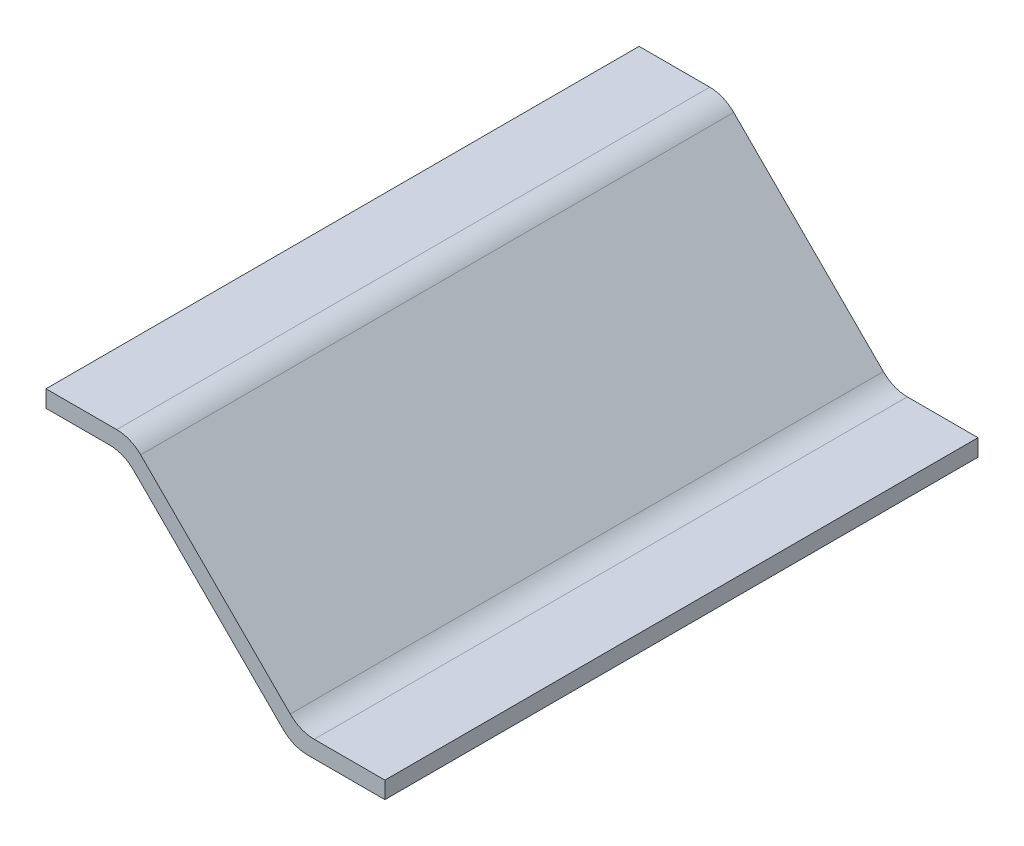
ISO-10303-21;
HEADER;
FILE_DESCRIPTION(('STEP AP214'),'2;1');
FILE_NAME('part.step','',(''),(''),'','','');
FILE_SCHEMA(('AUTOMOTIVE_DESIGN { 1 0 10303 214 1 1 1 1 }'));
ENDSEC;
DATA;
#1=APPLICATION_CONTEXT('core data for automotive mechanical design processes');
#2=APPLICATION_PROTOCOL_DEFINITION('international standard','automotive_design',2000,#1);
#3=PRODUCT_CONTEXT('',#1,'mechanical');
#4=PRODUCT('Part','Part','',(#3));
#5=PRODUCT_RELATED_PRODUCT_CATEGORY('part','',(#4));
#6=PRODUCT_DEFINITION_FORMATION('','',#4);
#7=PRODUCT_DEFINITION_CONTEXT('part definition',#1,'design');
#8=PRODUCT_DEFINITION('design','',#6,#7);
#9=PRODUCT_DEFINITION_SHAPE('','',#8);
#10=(LENGTH_UNIT() NAMED_UNIT(*) SI_UNIT(.MILLI.,.METRE.));
#11=(NAMED_UNIT(*) PLANE_ANGLE_UNIT() SI_UNIT($,.RADIAN.));
#12=(NAMED_UNIT(*) SI_UNIT($,.STERADIAN.) SOLID_ANGLE_UNIT());
#13=UNCERTAINTY_MEASURE_WITH_UNIT(LENGTH_MEASURE(1.E-05),#10,'distance_accuracy_value','');
#14=(GEOMETRIC_REPRESENTATION_CONTEXT(3) GLOBAL_UNCERTAINTY_ASSIGNED_CONTEXT((#13)) GLOBAL_UNIT_ASSIGNED_CONTEXT((#10,
#11,#12)) REPRESENTATION_CONTEXT('',''));
#15=CARTESIAN_POINT('',(0.,0.,0.));
#16=DIRECTION('',(0.,0.,1.));
#17=DIRECTION('',(1.,0.,0.));
#18=AXIS2_PLACEMENT_3D('',#15,#16,#17);
#19=CARTESIAN_POINT('',(0.,-0.1,1.75));
#20=DIRECTION('',(1.,0.,0.));
#21=DIRECTION('',(0.,0.,-1.));
#22=AXIS2_PLACEMENT_3D('',#19,#20,#21);
#23=PLANE('',#22);
#24=DIRECTION('',(0.,-1.,0.));
#25=VECTOR('',#24,1.);
#26=CARTESIAN_POINT('',(0.,-0.1,-1.75));
#27=LINE('',#26,#25);
#28=CARTESIAN_POINT('',(0.,0.,-1.75));
#29=VERTEX_POINT('',#28);
#30=CARTESIAN_POINT('',(0.,-0.1,-1.75));
#31=VERTEX_POINT('',#30);
#32=EDGE_CURVE('E145',#29,#31,#27,.T.);
#33=ORIENTED_EDGE('',*,*,#32,.T.);
#34=DIRECTION('',(0.,0.,-1.));
#35=VECTOR('',#34,1.);
#36=CARTESIAN_POINT('',(0.,-0.1,1.75));
#37=LINE('',#36,#35);
#38=CARTESIAN_POINT('',(0.,-0.1,1.75));
#39=VERTEX_POINT('',#38);
#40=EDGE_CURVE('E127',#39,#31,#37,.T.);
#41=ORIENTED_EDGE('',*,*,#40,.F.);
#42=DIRECTION('',(0.,-1.,0.));
#43=VECTOR('',#42,1.);
#44=CARTESIAN_POINT('',(0.,-0.1,1.75));
#45=LINE('',#44,#43);
#46=CARTESIAN_POINT('',(0.,0.,1.75));
#47=VERTEX_POINT('',#46);
#48=EDGE_CURVE('E133',#47,#39,#45,.T.);
#49=ORIENTED_EDGE('',*,*,#48,.F.);
#50=DIRECTION('',(0.,0.,-1.));
#51=VECTOR('',#50,1.);
#52=CARTESIAN_POINT('',(0.,0.,1.75));
#53=LINE('',#52,#51);
#54=EDGE_CURVE('E207',#47,#29,#53,.T.);
#55=ORIENTED_EDGE('',*,*,#54,.T.);
#56=EDGE_LOOP('',(#33,#41,#49,#55));
#57=FACE_BOUND('',#56,.T.);
#58=ADVANCED_FACE('F32',(#57),#23,.F.);
#59=CARTESIAN_POINT('',(0.,-0.1,1.75));
#60=DIRECTION('',(0.,1.,0.));
#61=DIRECTION('',(-1.,0.,0.));
#62=AXIS2_PLACEMENT_3D('',#59,#60,#61);
#63=PLANE('',#62);
#64=DIRECTION('',(1.,0.,0.));
#65=VECTOR('',#64,1.);
#66=CARTESIAN_POINT('',(0.,-0.1,-1.75));
#67=LINE('',#66,#65);
#68=CARTESIAN_POINT('',(0.375735931288085,-0.0999999999999995,-1.75));
#69=VERTEX_POINT('',#68);
#70=EDGE_CURVE('E214',#31,#69,#67,.T.);
#71=ORIENTED_EDGE('',*,*,#70,.T.);
#72=DIRECTION('',(0.,0.,-1.));
#73=VECTOR('',#72,1.);
#74=CARTESIAN_POINT('',(0.375735931288085,-0.0999999999999995,1.75));
#75=LINE('',#74,#73);
#76=CARTESIAN_POINT('',(0.375735931288085,-0.0999999999999995,1.75));
#77=VERTEX_POINT('',#76);
#78=EDGE_CURVE('E130',#69,#77,#75,.F.);
#79=ORIENTED_EDGE('',*,*,#78,.T.);
#80=DIRECTION('',(1.,0.,0.));
#81=VECTOR('',#80,1.);
#82=CARTESIAN_POINT('',(0.,-0.1,1.75));
#83=LINE('',#82,#81);
#84=EDGE_CURVE('E122',#39,#77,#83,.T.);
#85=ORIENTED_EDGE('',*,*,#84,.F.);
#86=ORIENTED_EDGE('',*,*,#40,.T.);
#87=EDGE_LOOP('',(#71,#79,#85,#86));
#88=FACE_BOUND('',#87,.T.);
#89=ADVANCED_FACE('F125',(#88),#63,.F.);
#90=CARTESIAN_POINT('',(0.458578643762704,-0.0999999999999994,1.75));
#91=DIRECTION('',(0.707106781186549,0.707106781186546,0.));
#92=DIRECTION('',(-0.707106781186546,0.707106781186549,0.));
#93=AXIS2_PLACEMENT_3D('',#90,#91,#92);
#94=PLANE('',#93);
#95=DIRECTION('',(0.707106781186546,-0.707106781186549,0.));
#96=VECTOR('',#95,1.);
#97=CARTESIAN_POINT('',(0.458578643762704,-0.0999999999999994,1.75));
#98=LINE('',#97,#96);
#99=CARTESIAN_POINT('',(0.517157287525395,-0.15857864376269,1.75));
#100=VERTEX_POINT('',#99);
#101=CARTESIAN_POINT('',(1.40000000000001,-1.04142135623731,1.75));
#102=VERTEX_POINT('',#101);
#103=EDGE_CURVE('E132',#100,#102,#98,.T.);
#104=ORIENTED_EDGE('',*,*,#103,.F.);
#105=DIRECTION('',(0.,0.,-1.));
#106=VECTOR('',#105,1.);
#107=CARTESIAN_POINT('',(0.517157287525395,-0.15857864376269,-1.75));
#108=LINE('',#107,#106);
#109=CARTESIAN_POINT('',(0.517157287525395,-0.15857864376269,-1.75));
#110=VERTEX_POINT('',#109);
#111=EDGE_CURVE('E149',#100,#110,#108,.T.);
#112=ORIENTED_EDGE('',*,*,#111,.T.);
#113=DIRECTION('',(0.707106781186546,-0.707106781186549,0.));
#114=VECTOR('',#113,1.);
#115=CARTESIAN_POINT('',(0.458578643762704,-0.0999999999999994,-1.75));
#116=LINE('',#115,#114);
#117=CARTESIAN_POINT('',(1.40000000000001,-1.04142135623731,-1.75));
#118=VERTEX_POINT('',#117);
#119=EDGE_CURVE('E216',#110,#118,#116,.T.);
#120=ORIENTED_EDGE('',*,*,#119,.T.);
#121=DIRECTION('',(0.,0.,-1.));
#122=VECTOR('',#121,1.);
#123=CARTESIAN_POINT('',(1.40000000000001,-1.04142135623731,1.75));
#124=LINE('',#123,#122);
#125=EDGE_CURVE('E146',#118,#102,#124,.F.);
#126=ORIENTED_EDGE('',*,*,#125,.T.);
#127=EDGE_LOOP('',(#104,#112,#120,#126));
#128=FACE_BOUND('',#127,.T.);
#129=ADVANCED_FACE('F233',(#128),#94,.F.);
#130=CARTESIAN_POINT('',(1.4585786437627,-1.1,1.75));
#131=DIRECTION('',(0.,1.,0.));
#132=DIRECTION('',(0.,0.,1.));
#133=AXIS2_PLACEMENT_3D('',#130,#131,#132);
#134=PLANE('',#133);
#135=DIRECTION('',(1.,0.,0.));
#136=VECTOR('',#135,1.);
#137=CARTESIAN_POINT('',(1.4585786437627,-1.1,1.75));
#138=LINE('',#137,#136);
#139=CARTESIAN_POINT('',(1.54142135623732,-1.1,1.75));
#140=VERTEX_POINT('',#139);
#141=CARTESIAN_POINT('',(2.,-1.1,1.75));
#142=VERTEX_POINT('',#141);
#143=EDGE_CURVE('E235',#140,#142,#138,.T.);
#144=ORIENTED_EDGE('',*,*,#143,.F.);
#145=DIRECTION('',(0.,0.,-1.));
#146=VECTOR('',#145,1.);
#147=CARTESIAN_POINT('',(1.54142135623732,-1.1,1.75));
#148=LINE('',#147,#146);
#149=CARTESIAN_POINT('',(1.54142135623732,-1.1,-1.75));
#150=VERTEX_POINT('',#149);
#151=EDGE_CURVE('E159',#140,#150,#148,.T.);
#152=ORIENTED_EDGE('',*,*,#151,.T.);
#153=DIRECTION('',(1.,0.,0.));
#154=VECTOR('',#153,1.);
#155=CARTESIAN_POINT('',(1.4585786437627,-1.1,-1.75));
#156=LINE('',#155,#154);
#157=CARTESIAN_POINT('',(2.,-1.1,-1.75));
#158=VERTEX_POINT('',#157);
#159=EDGE_CURVE('E219',#150,#158,#156,.T.);
#160=ORIENTED_EDGE('',*,*,#159,.T.);
#161=DIRECTION('',(0.,0.,-1.));
#162=VECTOR('',#161,1.);
#163=CARTESIAN_POINT('',(2.,-1.1,1.75));
#164=LINE('',#163,#162);
#165=EDGE_CURVE('E147',#142,#158,#164,.T.);
#166=ORIENTED_EDGE('',*,*,#165,.F.);
#167=EDGE_LOOP('',(#144,#152,#160,#166));
#168=FACE_BOUND('',#167,.T.);
#169=ADVANCED_FACE('F244',(#168),#134,.F.);
#170=CARTESIAN_POINT('',(2.,-1.1,1.75));
#171=DIRECTION('',(-1.,0.,0.));
#172=DIRECTION('',(0.,0.,1.));
#173=AXIS2_PLACEMENT_3D('',#170,#171,#172);
#174=PLANE('',#173);
#175=DIRECTION('',(0.,1.,0.));
#176=VECTOR('',#175,1.);
#177=CARTESIAN_POINT('',(2.,-1.1,-1.75));
#178=LINE('',#177,#176);
#179=CARTESIAN_POINT('',(2.,-1.,-1.75));
#180=VERTEX_POINT('',#179);
#181=EDGE_CURVE('E199',#158,#180,#178,.T.);
#182=ORIENTED_EDGE('',*,*,#181,.T.);
#183=DIRECTION('',(0.,0.,-1.));
#184=VECTOR('',#183,1.);
#185=CARTESIAN_POINT('',(2.,-1.,1.75));
#186=LINE('',#185,#184);
#187=CARTESIAN_POINT('',(2.,-1.,1.75));
#188=VERTEX_POINT('',#187);
#189=EDGE_CURVE('E152',#188,#180,#186,.T.);
#190=ORIENTED_EDGE('',*,*,#189,.F.);
#191=DIRECTION('',(0.,1.,0.));
#192=VECTOR('',#191,1.);
#193=CARTESIAN_POINT('',(2.,-1.1,1.75));
#194=LINE('',#193,#192);
#195=EDGE_CURVE('E209',#142,#188,#194,.T.);
#196=ORIENTED_EDGE('',*,*,#195,.F.);
#197=ORIENTED_EDGE('',*,*,#165,.T.);
#198=EDGE_LOOP('',(#182,#190,#196,#197));
#199=FACE_BOUND('',#198,.T.);
#200=ADVANCED_FACE('F242',(#199),#174,.F.);
#201=CARTESIAN_POINT('',(1.5,-1.,1.75));
#202=DIRECTION('',(0.,-1.,0.));
#203=DIRECTION('',(1.,0.,0.));
#204=AXIS2_PLACEMENT_3D('',#201,#202,#203);
#205=PLANE('',#204);
#206=DIRECTION('',(-1.,0.,0.));
#207=VECTOR('',#206,1.);
#208=CARTESIAN_POINT('',(1.5,-1.,-1.75));
#209=LINE('',#208,#207);
#210=CARTESIAN_POINT('',(1.58284271247462,-1.,-1.75));
#211=VERTEX_POINT('',#210);
#212=EDGE_CURVE('E188',#180,#211,#209,.T.);
#213=ORIENTED_EDGE('',*,*,#212,.T.);
#214=DIRECTION('',(0.,0.,-1.));
#215=VECTOR('',#214,1.);
#216=CARTESIAN_POINT('',(1.58284271247462,-1.,1.75));
#217=LINE('',#216,#215);
#218=CARTESIAN_POINT('',(1.58284271247462,-1.,1.75));
#219=VERTEX_POINT('',#218);
#220=EDGE_CURVE('E173',#211,#219,#217,.F.);
#221=ORIENTED_EDGE('',*,*,#220,.T.);
#222=DIRECTION('',(-1.,0.,0.));
#223=VECTOR('',#222,1.);
#224=CARTESIAN_POINT('',(1.5,-1.,1.75));
#225=LINE('',#224,#223);
#226=EDGE_CURVE('E204',#188,#219,#225,.T.);
#227=ORIENTED_EDGE('',*,*,#226,.F.);
#228=ORIENTED_EDGE('',*,*,#189,.T.);
#229=EDGE_LOOP('',(#213,#221,#227,#228));
#230=FACE_BOUND('',#229,.T.);
#231=ADVANCED_FACE('F195',(#230),#205,.F.);
#232=CARTESIAN_POINT('',(0.5,0.,1.75));
#233=DIRECTION('',(-0.707106781186547,-0.707106781186548,0.));
#234=DIRECTION('',(0.707106781186548,-0.707106781186547,0.));
#235=AXIS2_PLACEMENT_3D('',#232,#233,#234);
#236=PLANE('',#235);
#237=DIRECTION('',(-0.707106781186548,0.707106781186547,0.));
#238=VECTOR('',#237,1.);
#239=CARTESIAN_POINT('',(0.5,0.,1.75));
#240=LINE('',#239,#238);
#241=CARTESIAN_POINT('',(1.44142135623731,-0.94142135623731,1.75));
#242=VERTEX_POINT('',#241);
#243=CARTESIAN_POINT('',(0.558578643762691,-0.0585786437626904,1.75));
#244=VERTEX_POINT('',#243);
#245=EDGE_CURVE('E203',#242,#244,#240,.T.);
#246=ORIENTED_EDGE('',*,*,#245,.F.);
#247=DIRECTION('',(0.,0.,-1.));
#248=VECTOR('',#247,1.);
#249=CARTESIAN_POINT('',(1.44142135623731,-0.94142135623731,-1.75));
#250=LINE('',#249,#248);
#251=CARTESIAN_POINT('',(1.44142135623731,-0.94142135623731,-1.75));
#252=VERTEX_POINT('',#251);
#253=EDGE_CURVE('E170',#242,#252,#250,.T.);
#254=ORIENTED_EDGE('',*,*,#253,.T.);
#255=DIRECTION('',(-0.707106781186548,0.707106781186547,0.));
#256=VECTOR('',#255,1.);
#257=CARTESIAN_POINT('',(0.5,0.,-1.75));
#258=LINE('',#257,#256);
#259=CARTESIAN_POINT('',(0.558578643762691,-0.0585786437626904,-1.75));
#260=VERTEX_POINT('',#259);
#261=EDGE_CURVE('E189',#252,#260,#258,.T.);
#262=ORIENTED_EDGE('',*,*,#261,.T.);
#263=DIRECTION('',(0.,0.,-1.));
#264=VECTOR('',#263,1.);
#265=CARTESIAN_POINT('',(0.558578643762691,-0.0585786437626904,1.75));
#266=LINE('',#265,#264);
#267=EDGE_CURVE('E55',#260,#244,#266,.F.);
#268=ORIENTED_EDGE('',*,*,#267,.T.);
#269=EDGE_LOOP('',(#246,#254,#262,#268));
#270=FACE_BOUND('',#269,.T.);
#271=ADVANCED_FACE('F205',(#270),#236,.F.);
#272=CARTESIAN_POINT('',(0.,0.,1.75));
#273=DIRECTION('',(0.,-1.,0.));
#274=DIRECTION('',(0.,0.,-1.));
#275=AXIS2_PLACEMENT_3D('',#272,#273,#274);
#276=PLANE('',#275);
#277=DIRECTION('',(-1.,0.,0.));
#278=VECTOR('',#277,1.);
#279=CARTESIAN_POINT('',(0.,0.,1.75));
#280=LINE('',#279,#278);
#281=CARTESIAN_POINT('',(0.417157287525381,0.,1.75));
#282=VERTEX_POINT('',#281);
#283=EDGE_CURVE('E138',#282,#47,#280,.T.);
#284=ORIENTED_EDGE('',*,*,#283,.F.);
#285=DIRECTION('',(0.,0.,-1.));
#286=VECTOR('',#285,1.);
#287=CARTESIAN_POINT('',(0.417157287525381,0.,1.75));
#288=LINE('',#287,#286);
#289=CARTESIAN_POINT('',(0.417157287525381,0.,-1.75));
#290=VERTEX_POINT('',#289);
#291=EDGE_CURVE('E175',#282,#290,#288,.T.);
#292=ORIENTED_EDGE('',*,*,#291,.T.);
#293=DIRECTION('',(-1.,0.,0.));
#294=VECTOR('',#293,1.);
#295=CARTESIAN_POINT('',(0.,0.,-1.75));
#296=LINE('',#295,#294);
#297=EDGE_CURVE('E142',#290,#29,#296,.T.);
#298=ORIENTED_EDGE('',*,*,#297,.T.);
#299=ORIENTED_EDGE('',*,*,#54,.F.);
#300=EDGE_LOOP('',(#284,#292,#298,#299));
#301=FACE_BOUND('',#300,.T.);
#302=ADVANCED_FACE('F272',(#301),#276,.F.);
#303=CARTESIAN_POINT('',(0.,0.,1.75));
#304=DIRECTION('',(0.,0.,-1.));
#305=DIRECTION('',(-1.,0.,0.));
#306=AXIS2_PLACEMENT_3D('',#303,#304,#305);
#307=PLANE('',#306);
#308=ORIENTED_EDGE('',*,*,#103,.T.);
#309=CARTESIAN_POINT('',(1.54142135623732,-0.900000000000001,1.75));
#310=DIRECTION('',(0.,0.,-1.));
#311=DIRECTION('',(-1.,0.,0.));
#312=AXIS2_PLACEMENT_3D('',#309,#310,#311);
#313=CIRCLE('',#312,0.2);
#314=EDGE_CURVE('E167',#102,#140,#313,.F.);
#315=ORIENTED_EDGE('',*,*,#314,.T.);
#316=ORIENTED_EDGE('',*,*,#143,.T.);
#317=ORIENTED_EDGE('',*,*,#195,.T.);
#318=ORIENTED_EDGE('',*,*,#226,.T.);
#319=CARTESIAN_POINT('',(1.58284271247462,-0.8,1.75));
#320=DIRECTION('',(0.,0.,-1.));
#321=DIRECTION('',(-1.,0.,0.));
#322=AXIS2_PLACEMENT_3D('',#319,#320,#321);
#323=CIRCLE('',#322,0.2);
#324=EDGE_CURVE('E11',#219,#242,#323,.T.);
#325=ORIENTED_EDGE('',*,*,#324,.T.);
#326=ORIENTED_EDGE('',*,*,#245,.T.);
#327=CARTESIAN_POINT('',(0.417157287525381,-0.2,1.75));
#328=DIRECTION('',(0.,0.,-1.));
#329=DIRECTION('',(-1.,0.,0.));
#330=AXIS2_PLACEMENT_3D('',#327,#328,#329);
#331=CIRCLE('',#330,0.2);
#332=EDGE_CURVE('E47',#244,#282,#331,.F.);
#333=ORIENTED_EDGE('',*,*,#332,.T.);
#334=ORIENTED_EDGE('',*,*,#283,.T.);
#335=ORIENTED_EDGE('',*,*,#48,.T.);
#336=ORIENTED_EDGE('',*,*,#84,.T.);
#337=CARTESIAN_POINT('',(0.375735931288085,-0.3,1.75));
#338=DIRECTION('',(0.,0.,-1.));
#339=DIRECTION('',(-1.,0.,0.));
#340=AXIS2_PLACEMENT_3D('',#337,#338,#339);
#341=CIRCLE('',#340,0.2);
#342=EDGE_CURVE('E180',#77,#100,#341,.T.);
#343=ORIENTED_EDGE('',*,*,#342,.T.);
#344=EDGE_LOOP('',(#308,#315,#316,#317,#318,#325,#326,#333,#334,#335,#336,#343));
#345=FACE_BOUND('',#344,.T.);
#346=ADVANCED_FACE('F137',(#345),#307,.F.);
#347=CARTESIAN_POINT('',(0.,0.,-1.75));
#348=DIRECTION('',(0.,0.,-1.));
#349=DIRECTION('',(-1.,0.,0.));
#350=AXIS2_PLACEMENT_3D('',#347,#348,#349);
#351=PLANE('',#350);
#352=ORIENTED_EDGE('',*,*,#159,.F.);
#353=CARTESIAN_POINT('',(1.54142135623732,-0.900000000000001,-1.75));
#354=DIRECTION('',(0.,0.,-1.));
#355=DIRECTION('',(-1.,0.,0.));
#356=AXIS2_PLACEMENT_3D('',#353,#354,#355);
#357=CIRCLE('',#356,0.2);
#358=EDGE_CURVE('E164',#150,#118,#357,.T.);
#359=ORIENTED_EDGE('',*,*,#358,.T.);
#360=ORIENTED_EDGE('',*,*,#119,.F.);
#361=CARTESIAN_POINT('',(0.375735931288085,-0.3,-1.75));
#362=DIRECTION('',(0.,0.,-1.));
#363=DIRECTION('',(-1.,0.,0.));
#364=AXIS2_PLACEMENT_3D('',#361,#362,#363);
#365=CIRCLE('',#364,0.2);
#366=EDGE_CURVE('E178',#110,#69,#365,.F.);
#367=ORIENTED_EDGE('',*,*,#366,.T.);
#368=ORIENTED_EDGE('',*,*,#70,.F.);
#369=ORIENTED_EDGE('',*,*,#32,.F.);
#370=ORIENTED_EDGE('',*,*,#297,.F.);
#371=CARTESIAN_POINT('',(0.417157287525381,-0.2,-1.75));
#372=DIRECTION('',(0.,0.,-1.));
#373=DIRECTION('',(-1.,0.,0.));
#374=AXIS2_PLACEMENT_3D('',#371,#372,#373);
#375=CIRCLE('',#374,0.2);
#376=EDGE_CURVE('E162',#290,#260,#375,.T.);
#377=ORIENTED_EDGE('',*,*,#376,.T.);
#378=ORIENTED_EDGE('',*,*,#261,.F.);
#379=CARTESIAN_POINT('',(1.58284271247462,-0.8,-1.75));
#380=DIRECTION('',(0.,0.,-1.));
#381=DIRECTION('',(-1.,0.,0.));
#382=AXIS2_PLACEMENT_3D('',#379,#380,#381);
#383=CIRCLE('',#382,0.2);
#384=EDGE_CURVE('E40',#252,#211,#383,.F.);
#385=ORIENTED_EDGE('',*,*,#384,.T.);
#386=ORIENTED_EDGE('',*,*,#212,.F.);
#387=ORIENTED_EDGE('',*,*,#181,.F.);
#388=EDGE_LOOP('',(#352,#359,#360,#367,#368,#369,#370,#377,#378,#385,#386,#387));
#389=FACE_BOUND('',#388,.T.);
#390=ADVANCED_FACE('F186',(#389),#351,.T.);
#391=CARTESIAN_POINT('',(0.375735931288085,-0.3,1.75));
#392=DIRECTION('',(0.,0.,1.));
#393=DIRECTION('',(1.,0.,0.));
#394=AXIS2_PLACEMENT_3D('',#391,#392,#393);
#395=CYLINDRICAL_SURFACE('',#394,0.2);
#396=ORIENTED_EDGE('',*,*,#342,.F.);
#397=ORIENTED_EDGE('',*,*,#78,.F.);
#398=ORIENTED_EDGE('',*,*,#366,.F.);
#399=ORIENTED_EDGE('',*,*,#111,.F.);
#400=EDGE_LOOP('',(#396,#397,#398,#399));
#401=FACE_BOUND('',#400,.T.);
#402=ADVANCED_FACE('F228',(#401),#395,.F.);
#403=CARTESIAN_POINT('',(1.54142135623732,-0.900000000000001,1.75));
#404=DIRECTION('',(0.,0.,-1.));
#405=DIRECTION('',(-1.,0.,0.));
#406=AXIS2_PLACEMENT_3D('',#403,#404,#405);
#407=CYLINDRICAL_SURFACE('',#406,0.2);
#408=ORIENTED_EDGE('',*,*,#314,.F.);
#409=ORIENTED_EDGE('',*,*,#125,.F.);
#410=ORIENTED_EDGE('',*,*,#358,.F.);
#411=ORIENTED_EDGE('',*,*,#151,.F.);
#412=EDGE_LOOP('',(#408,#409,#410,#411));
#413=FACE_BOUND('',#412,.T.);
#414=ADVANCED_FACE('F247',(#413),#407,.T.);
#415=CARTESIAN_POINT('',(1.58284271247462,-0.8,1.75));
#416=DIRECTION('',(0.,0.,1.));
#417=DIRECTION('',(1.,0.,0.));
#418=AXIS2_PLACEMENT_3D('',#415,#416,#417);
#419=CYLINDRICAL_SURFACE('',#418,0.2);
#420=ORIENTED_EDGE('',*,*,#324,.F.);
#421=ORIENTED_EDGE('',*,*,#220,.F.);
#422=ORIENTED_EDGE('',*,*,#384,.F.);
#423=ORIENTED_EDGE('',*,*,#253,.F.);
#424=EDGE_LOOP('',(#420,#421,#422,#423));
#425=FACE_BOUND('',#424,.T.);
#426=ADVANCED_FACE('F202',(#425),#419,.F.);
#427=CARTESIAN_POINT('',(0.417157287525381,-0.2,1.75));
#428=DIRECTION('',(0.,0.,-1.));
#429=DIRECTION('',(-1.,0.,0.));
#430=AXIS2_PLACEMENT_3D('',#427,#428,#429);
#431=CYLINDRICAL_SURFACE('',#430,0.2);
#432=ORIENTED_EDGE('',*,*,#332,.F.);
#433=ORIENTED_EDGE('',*,*,#267,.F.);
#434=ORIENTED_EDGE('',*,*,#376,.F.);
#435=ORIENTED_EDGE('',*,*,#291,.F.);
#436=EDGE_LOOP('',(#432,#433,#434,#435));
#437=FACE_BOUND('',#436,.T.);
#438=ADVANCED_FACE('F34',(#437),#431,.T.);
#439=CLOSED_SHELL('',(#58,#89,#129,#169,#200,#231,#271,#302,#346,#390,#402,#414,#426,#438));
#440=MANIFOLD_SOLID_BREP('B2',#439);
#441=ADVANCED_BREP_SHAPE_REPRESENTATION('',(#18,#440),#14);
#442=SHAPE_DEFINITION_REPRESENTATION(#9,#441);
ENDSEC;
END-ISO-10303-21;
